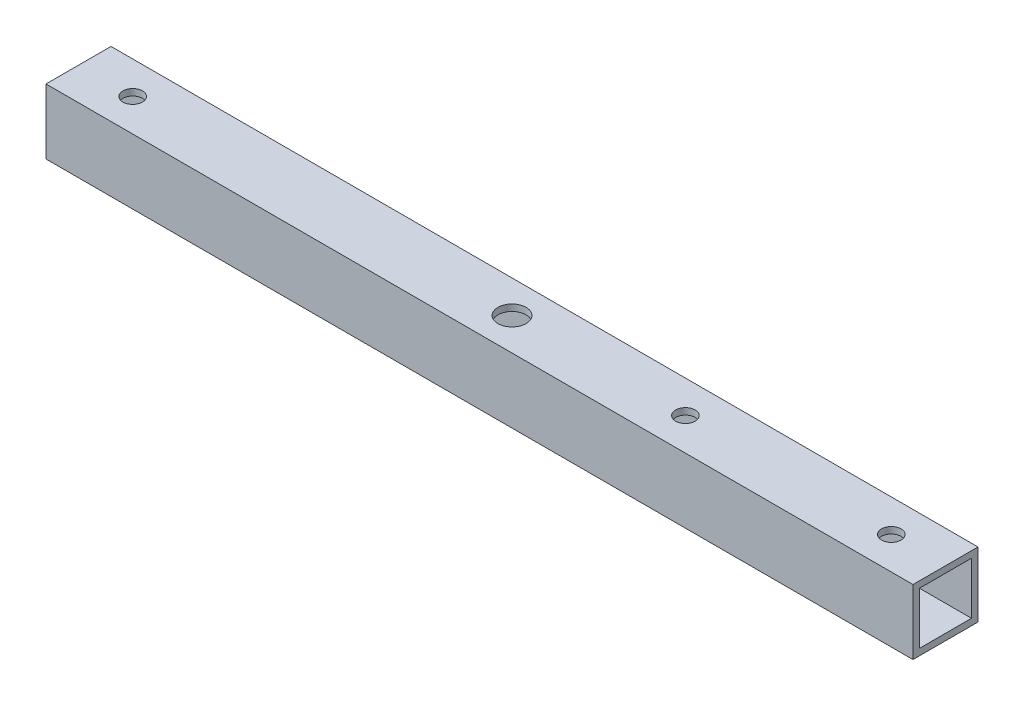
ISO-10303-21;
HEADER;
FILE_DESCRIPTION(('STEP AP214'),'2;1');
FILE_NAME('part.step','',(''),(''),'','','');
FILE_SCHEMA(('AUTOMOTIVE_DESIGN { 1 0 10303 214 1 1 1 1 }'));
ENDSEC;
DATA;
#1=APPLICATION_CONTEXT('core data for automotive mechanical design processes');
#2=APPLICATION_PROTOCOL_DEFINITION('international standard','automotive_design',2000,#1);
#3=PRODUCT_CONTEXT('',#1,'mechanical');
#4=PRODUCT('Part','Part','',(#3));
#5=PRODUCT_RELATED_PRODUCT_CATEGORY('part','',(#4));
#6=PRODUCT_DEFINITION_FORMATION('','',#4);
#7=PRODUCT_DEFINITION_CONTEXT('part definition',#1,'design');
#8=PRODUCT_DEFINITION('design','',#6,#7);
#9=PRODUCT_DEFINITION_SHAPE('','',#8);
#10=(LENGTH_UNIT() NAMED_UNIT(*) SI_UNIT(.MILLI.,.METRE.));
#11=(NAMED_UNIT(*) PLANE_ANGLE_UNIT() SI_UNIT($,.RADIAN.));
#12=(NAMED_UNIT(*) SI_UNIT($,.STERADIAN.) SOLID_ANGLE_UNIT());
#13=UNCERTAINTY_MEASURE_WITH_UNIT(LENGTH_MEASURE(1.E-05),#10,'distance_accuracy_value','');
#14=(GEOMETRIC_REPRESENTATION_CONTEXT(3) GLOBAL_UNCERTAINTY_ASSIGNED_CONTEXT((#13)) GLOBAL_UNIT_ASSIGNED_CONTEXT((#10,
#11,#12)) REPRESENTATION_CONTEXT('',''));
#15=CARTESIAN_POINT('',(0.,0.,0.));
#16=DIRECTION('',(0.,0.,1.));
#17=DIRECTION('',(1.,0.,0.));
#18=AXIS2_PLACEMENT_3D('',#15,#16,#17);
#19=CARTESIAN_POINT('',(200.,0.,0.));
#20=DIRECTION('',(1.,0.,0.));
#21=DIRECTION('',(0.,0.,-1.));
#22=AXIS2_PLACEMENT_3D('',#19,#20,#21);
#23=PLANE('',#22);
#24=DIRECTION('',(0.,1.,0.));
#25=VECTOR('',#24,1.);
#26=CARTESIAN_POINT('',(200.,7.5,-7.5));
#27=LINE('',#26,#25);
#28=CARTESIAN_POINT('',(200.,-7.5,-7.5));
#29=VERTEX_POINT('',#28);
#30=CARTESIAN_POINT('',(200.,7.5,-7.5));
#31=VERTEX_POINT('',#30);
#32=EDGE_CURVE('E138',#29,#31,#27,.T.);
#33=ORIENTED_EDGE('',*,*,#32,.T.);
#34=DIRECTION('',(0.,0.,1.));
#35=VECTOR('',#34,1.);
#36=CARTESIAN_POINT('',(200.,7.5,7.5));
#37=LINE('',#36,#35);
#38=CARTESIAN_POINT('',(200.,7.5,7.5));
#39=VERTEX_POINT('',#38);
#40=EDGE_CURVE('E141',#31,#39,#37,.T.);
#41=ORIENTED_EDGE('',*,*,#40,.T.);
#42=DIRECTION('',(0.,-1.,0.));
#43=VECTOR('',#42,1.);
#44=CARTESIAN_POINT('',(200.,7.5,7.5));
#45=LINE('',#44,#43);
#46=CARTESIAN_POINT('',(200.,-7.5,7.5));
#47=VERTEX_POINT('',#46);
#48=EDGE_CURVE('E144',#39,#47,#45,.T.);
#49=ORIENTED_EDGE('',*,*,#48,.T.);
#50=DIRECTION('',(0.,0.,-1.));
#51=VECTOR('',#50,1.);
#52=CARTESIAN_POINT('',(200.,-7.5,7.5));
#53=LINE('',#52,#51);
#54=EDGE_CURVE('E146',#47,#29,#53,.T.);
#55=ORIENTED_EDGE('',*,*,#54,.T.);
#56=EDGE_LOOP('',(#33,#41,#49,#55));
#57=FACE_BOUND('',#56,.T.);
#58=DIRECTION('',(0.,0.,-1.));
#59=VECTOR('',#58,1.);
#60=CARTESIAN_POINT('',(200.,-6.,6.));
#61=LINE('',#60,#59);
#62=CARTESIAN_POINT('',(200.,-6.,6.));
#63=VERTEX_POINT('',#62);
#64=CARTESIAN_POINT('',(200.,-6.,-6.));
#65=VERTEX_POINT('',#64);
#66=EDGE_CURVE('E108',#63,#65,#61,.T.);
#67=ORIENTED_EDGE('',*,*,#66,.F.);
#68=DIRECTION('',(0.,-1.,0.));
#69=VECTOR('',#68,1.);
#70=CARTESIAN_POINT('',(200.,6.,6.));
#71=LINE('',#70,#69);
#72=CARTESIAN_POINT('',(200.,6.,6.));
#73=VERTEX_POINT('',#72);
#74=EDGE_CURVE('E100',#73,#63,#71,.T.);
#75=ORIENTED_EDGE('',*,*,#74,.F.);
#76=DIRECTION('',(0.,0.,1.));
#77=VECTOR('',#76,1.);
#78=CARTESIAN_POINT('',(200.,6.,6.));
#79=LINE('',#78,#77);
#80=CARTESIAN_POINT('',(200.,6.,-6.));
#81=VERTEX_POINT('',#80);
#82=EDGE_CURVE('E122',#81,#73,#79,.T.);
#83=ORIENTED_EDGE('',*,*,#82,.F.);
#84=DIRECTION('',(0.,1.,0.));
#85=VECTOR('',#84,1.);
#86=CARTESIAN_POINT('',(200.,6.,-6.));
#87=LINE('',#86,#85);
#88=EDGE_CURVE('E120',#65,#81,#87,.T.);
#89=ORIENTED_EDGE('',*,*,#88,.F.);
#90=EDGE_LOOP('',(#67,#75,#83,#89));
#91=FACE_BOUND('',#90,.T.);
#92=ADVANCED_FACE('F33',(#57,#91),#23,.T.);
#93=CARTESIAN_POINT('',(0.,0.,0.));
#94=DIRECTION('',(1.,0.,0.));
#95=DIRECTION('',(0.,0.,-1.));
#96=AXIS2_PLACEMENT_3D('',#93,#94,#95);
#97=PLANE('',#96);
#98=DIRECTION('',(0.,1.,0.));
#99=VECTOR('',#98,1.);
#100=CARTESIAN_POINT('',(0.,7.5,-7.5));
#101=LINE('',#100,#99);
#102=CARTESIAN_POINT('',(0.,-7.5,-7.5));
#103=VERTEX_POINT('',#102);
#104=CARTESIAN_POINT('',(0.,7.5,-7.5));
#105=VERTEX_POINT('',#104);
#106=EDGE_CURVE('E116',#103,#105,#101,.T.);
#107=ORIENTED_EDGE('',*,*,#106,.F.);
#108=DIRECTION('',(0.,0.,-1.));
#109=VECTOR('',#108,1.);
#110=CARTESIAN_POINT('',(0.,-7.5,7.5));
#111=LINE('',#110,#109);
#112=CARTESIAN_POINT('',(0.,-7.5,7.5));
#113=VERTEX_POINT('',#112);
#114=EDGE_CURVE('E142',#113,#103,#111,.T.);
#115=ORIENTED_EDGE('',*,*,#114,.F.);
#116=DIRECTION('',(0.,-1.,0.));
#117=VECTOR('',#116,1.);
#118=CARTESIAN_POINT('',(0.,7.5,7.5));
#119=LINE('',#118,#117);
#120=CARTESIAN_POINT('',(0.,7.5,7.5));
#121=VERTEX_POINT('',#120);
#122=EDGE_CURVE('E153',#121,#113,#119,.T.);
#123=ORIENTED_EDGE('',*,*,#122,.F.);
#124=DIRECTION('',(0.,0.,1.));
#125=VECTOR('',#124,1.);
#126=CARTESIAN_POINT('',(0.,7.5,7.5));
#127=LINE('',#126,#125);
#128=EDGE_CURVE('E151',#105,#121,#127,.T.);
#129=ORIENTED_EDGE('',*,*,#128,.F.);
#130=EDGE_LOOP('',(#107,#115,#123,#129));
#131=FACE_BOUND('',#130,.T.);
#132=DIRECTION('',(0.,-1.,0.));
#133=VECTOR('',#132,1.);
#134=CARTESIAN_POINT('',(0.,6.,6.));
#135=LINE('',#134,#133);
#136=CARTESIAN_POINT('',(0.,6.,6.));
#137=VERTEX_POINT('',#136);
#138=CARTESIAN_POINT('',(0.,-6.,6.));
#139=VERTEX_POINT('',#138);
#140=EDGE_CURVE('E58',#137,#139,#135,.T.);
#141=ORIENTED_EDGE('',*,*,#140,.T.);
#142=DIRECTION('',(0.,0.,-1.));
#143=VECTOR('',#142,1.);
#144=CARTESIAN_POINT('',(0.,-6.,6.));
#145=LINE('',#144,#143);
#146=CARTESIAN_POINT('',(0.,-6.,-6.));
#147=VERTEX_POINT('',#146);
#148=EDGE_CURVE('E115',#139,#147,#145,.T.);
#149=ORIENTED_EDGE('',*,*,#148,.T.);
#150=DIRECTION('',(0.,1.,0.));
#151=VECTOR('',#150,1.);
#152=CARTESIAN_POINT('',(0.,6.,-6.));
#153=LINE('',#152,#151);
#154=CARTESIAN_POINT('',(0.,6.,-6.));
#155=VERTEX_POINT('',#154);
#156=EDGE_CURVE('E130',#147,#155,#153,.T.);
#157=ORIENTED_EDGE('',*,*,#156,.T.);
#158=DIRECTION('',(0.,0.,1.));
#159=VECTOR('',#158,1.);
#160=CARTESIAN_POINT('',(0.,6.,6.));
#161=LINE('',#160,#159);
#162=EDGE_CURVE('E109',#155,#137,#161,.T.);
#163=ORIENTED_EDGE('',*,*,#162,.T.);
#164=EDGE_LOOP('',(#141,#149,#157,#163));
#165=FACE_BOUND('',#164,.T.);
#166=ADVANCED_FACE('F223',(#131,#165),#97,.F.);
#167=CARTESIAN_POINT('',(200.,7.5,-7.5));
#168=DIRECTION('',(0.,0.,1.));
#169=DIRECTION('',(0.,-1.,0.));
#170=AXIS2_PLACEMENT_3D('',#167,#168,#169);
#171=PLANE('',#170);
#172=ORIENTED_EDGE('',*,*,#106,.T.);
#173=DIRECTION('',(-1.,0.,0.));
#174=VECTOR('',#173,1.);
#175=CARTESIAN_POINT('',(200.,7.5,-7.5));
#176=LINE('',#175,#174);
#177=EDGE_CURVE('E11',#31,#105,#176,.T.);
#178=ORIENTED_EDGE('',*,*,#177,.F.);
#179=ORIENTED_EDGE('',*,*,#32,.F.);
#180=DIRECTION('',(-1.,0.,0.));
#181=VECTOR('',#180,1.);
#182=CARTESIAN_POINT('',(200.,-7.5,-7.5));
#183=LINE('',#182,#181);
#184=EDGE_CURVE('E148',#29,#103,#183,.T.);
#185=ORIENTED_EDGE('',*,*,#184,.T.);
#186=EDGE_LOOP('',(#172,#178,#179,#185));
#187=FACE_BOUND('',#186,.T.);
#188=ADVANCED_FACE('F35',(#187),#171,.F.);
#189=CARTESIAN_POINT('',(200.,7.5,7.5));
#190=DIRECTION('',(0.,-1.,0.));
#191=DIRECTION('',(0.,0.,-1.));
#192=AXIS2_PLACEMENT_3D('',#189,#190,#191);
#193=PLANE('',#192);
#194=CARTESIAN_POINT('',(187.5,7.5,0.));
#195=DIRECTION('',(0.,1.,0.));
#196=DIRECTION('',(0.,0.,-1.));
#197=AXIS2_PLACEMENT_3D('',#194,#195,#196);
#198=CIRCLE('',#197,2.24999999999998);
#199=CARTESIAN_POINT('',(187.5,7.5,-2.25));
#200=VERTEX_POINT('',#199);
#201=EDGE_CURVE('E248',#200,#200,#198,.T.);
#202=ORIENTED_EDGE('',*,*,#201,.F.);
#203=EDGE_LOOP('',(#202));
#204=FACE_BOUND('',#203,.T.);
#205=CARTESIAN_POINT('',(12.5,7.5,0.));
#206=DIRECTION('',(0.,1.,0.));
#207=DIRECTION('',(0.,0.,1.));
#208=AXIS2_PLACEMENT_3D('',#205,#206,#207);
#209=CIRCLE('',#208,2.25);
#210=CARTESIAN_POINT('',(12.5,7.5,2.25));
#211=VERTEX_POINT('',#210);
#212=EDGE_CURVE('E181',#211,#211,#209,.T.);
#213=ORIENTED_EDGE('',*,*,#212,.F.);
#214=EDGE_LOOP('',(#213));
#215=FACE_BOUND('',#214,.T.);
#216=CARTESIAN_POINT('',(140.,7.5,0.));
#217=DIRECTION('',(0.,1.,0.));
#218=DIRECTION('',(0.,0.,1.));
#219=AXIS2_PLACEMENT_3D('',#216,#217,#218);
#220=CIRCLE('',#219,2.25000000000001);
#221=CARTESIAN_POINT('',(140.,7.5,2.25000000000001));
#222=VERTEX_POINT('',#221);
#223=EDGE_CURVE('E178',#222,#222,#220,.T.);
#224=ORIENTED_EDGE('',*,*,#223,.F.);
#225=EDGE_LOOP('',(#224));
#226=FACE_BOUND('',#225,.T.);
#227=CARTESIAN_POINT('',(100.,7.5,0.));
#228=DIRECTION('',(0.,1.,0.));
#229=DIRECTION('',(0.,0.,1.));
#230=AXIS2_PLACEMENT_3D('',#227,#228,#229);
#231=CIRCLE('',#230,3.25000000000001);
#232=CARTESIAN_POINT('',(100.,7.5,3.25000000000001));
#233=VERTEX_POINT('',#232);
#234=EDGE_CURVE('E197',#233,#233,#231,.T.);
#235=ORIENTED_EDGE('',*,*,#234,.F.);
#236=EDGE_LOOP('',(#235));
#237=FACE_BOUND('',#236,.T.);
#238=ORIENTED_EDGE('',*,*,#128,.T.);
#239=DIRECTION('',(-1.,0.,0.));
#240=VECTOR('',#239,1.);
#241=CARTESIAN_POINT('',(200.,7.5,7.5));
#242=LINE('',#241,#240);
#243=EDGE_CURVE('E42',#39,#121,#242,.T.);
#244=ORIENTED_EDGE('',*,*,#243,.F.);
#245=ORIENTED_EDGE('',*,*,#40,.F.);
#246=ORIENTED_EDGE('',*,*,#177,.T.);
#247=EDGE_LOOP('',(#238,#244,#245,#246));
#248=FACE_BOUND('',#247,.T.);
#249=ADVANCED_FACE('F237',(#204,#215,#226,#237,#248),#193,.F.);
#250=CARTESIAN_POINT('',(200.,7.5,7.5));
#251=DIRECTION('',(0.,0.,-1.));
#252=DIRECTION('',(0.,1.,0.));
#253=AXIS2_PLACEMENT_3D('',#250,#251,#252);
#254=PLANE('',#253);
#255=ORIENTED_EDGE('',*,*,#122,.T.);
#256=DIRECTION('',(-1.,0.,0.));
#257=VECTOR('',#256,1.);
#258=CARTESIAN_POINT('',(200.,-7.5,7.5));
#259=LINE('',#258,#257);
#260=EDGE_CURVE('E158',#47,#113,#259,.T.);
#261=ORIENTED_EDGE('',*,*,#260,.F.);
#262=ORIENTED_EDGE('',*,*,#48,.F.);
#263=ORIENTED_EDGE('',*,*,#243,.T.);
#264=EDGE_LOOP('',(#255,#261,#262,#263));
#265=FACE_BOUND('',#264,.T.);
#266=ADVANCED_FACE('F234',(#265),#254,.F.);
#267=CARTESIAN_POINT('',(200.,-7.5,7.5));
#268=DIRECTION('',(0.,1.,0.));
#269=DIRECTION('',(0.,0.,1.));
#270=AXIS2_PLACEMENT_3D('',#267,#268,#269);
#271=PLANE('',#270);
#272=CARTESIAN_POINT('',(187.5,-7.5,0.));
#273=DIRECTION('',(0.,1.,0.));
#274=DIRECTION('',(0.,0.,-1.));
#275=AXIS2_PLACEMENT_3D('',#272,#273,#274);
#276=CIRCLE('',#275,2.24999999999998);
#277=CARTESIAN_POINT('',(187.5,-7.5,-2.25));
#278=VERTEX_POINT('',#277);
#279=EDGE_CURVE('E301',#278,#278,#276,.T.);
#280=ORIENTED_EDGE('',*,*,#279,.T.);
#281=EDGE_LOOP('',(#280));
#282=FACE_BOUND('',#281,.T.);
#283=CARTESIAN_POINT('',(12.5,-7.5,0.));
#284=DIRECTION('',(0.,1.,0.));
#285=DIRECTION('',(0.,0.,1.));
#286=AXIS2_PLACEMENT_3D('',#283,#284,#285);
#287=CIRCLE('',#286,2.25);
#288=CARTESIAN_POINT('',(12.5,-7.5,2.25));
#289=VERTEX_POINT('',#288);
#290=EDGE_CURVE('E174',#289,#289,#287,.T.);
#291=ORIENTED_EDGE('',*,*,#290,.T.);
#292=EDGE_LOOP('',(#291));
#293=FACE_BOUND('',#292,.T.);
#294=CARTESIAN_POINT('',(140.,-7.5,0.));
#295=DIRECTION('',(0.,1.,0.));
#296=DIRECTION('',(0.,0.,1.));
#297=AXIS2_PLACEMENT_3D('',#294,#295,#296);
#298=CIRCLE('',#297,2.25000000000001);
#299=CARTESIAN_POINT('',(140.,-7.5,2.25000000000001));
#300=VERTEX_POINT('',#299);
#301=EDGE_CURVE('E170',#300,#300,#298,.T.);
#302=ORIENTED_EDGE('',*,*,#301,.T.);
#303=EDGE_LOOP('',(#302));
#304=FACE_BOUND('',#303,.T.);
#305=CARTESIAN_POINT('',(100.,-7.5,0.));
#306=DIRECTION('',(0.,1.,0.));
#307=DIRECTION('',(0.,0.,1.));
#308=AXIS2_PLACEMENT_3D('',#305,#306,#307);
#309=CIRCLE('',#308,3.25000000000001);
#310=CARTESIAN_POINT('',(100.,-7.5,3.25000000000001));
#311=VERTEX_POINT('',#310);
#312=EDGE_CURVE('E166',#311,#311,#309,.T.);
#313=ORIENTED_EDGE('',*,*,#312,.T.);
#314=EDGE_LOOP('',(#313));
#315=FACE_BOUND('',#314,.T.);
#316=ORIENTED_EDGE('',*,*,#114,.T.);
#317=ORIENTED_EDGE('',*,*,#184,.F.);
#318=ORIENTED_EDGE('',*,*,#54,.F.);
#319=ORIENTED_EDGE('',*,*,#260,.T.);
#320=EDGE_LOOP('',(#316,#317,#318,#319));
#321=FACE_BOUND('',#320,.T.);
#322=ADVANCED_FACE('F218',(#282,#293,#304,#315,#321),#271,.F.);
#323=CARTESIAN_POINT('',(200.,6.,6.));
#324=DIRECTION('',(0.,0.,-1.));
#325=DIRECTION('',(0.,1.,0.));
#326=AXIS2_PLACEMENT_3D('',#323,#324,#325);
#327=PLANE('',#326);
#328=ORIENTED_EDGE('',*,*,#140,.F.);
#329=DIRECTION('',(-1.,0.,0.));
#330=VECTOR('',#329,1.);
#331=CARTESIAN_POINT('',(200.,6.,6.));
#332=LINE('',#331,#330);
#333=EDGE_CURVE('E104',#73,#137,#332,.T.);
#334=ORIENTED_EDGE('',*,*,#333,.F.);
#335=ORIENTED_EDGE('',*,*,#74,.T.);
#336=DIRECTION('',(-1.,0.,0.));
#337=VECTOR('',#336,1.);
#338=CARTESIAN_POINT('',(200.,-6.,6.));
#339=LINE('',#338,#337);
#340=EDGE_CURVE('E103',#63,#139,#339,.T.);
#341=ORIENTED_EDGE('',*,*,#340,.T.);
#342=EDGE_LOOP('',(#328,#334,#335,#341));
#343=FACE_BOUND('',#342,.T.);
#344=ADVANCED_FACE('F102',(#343),#327,.T.);
#345=CARTESIAN_POINT('',(200.,-6.,6.));
#346=DIRECTION('',(0.,1.,0.));
#347=DIRECTION('',(0.,0.,1.));
#348=AXIS2_PLACEMENT_3D('',#345,#346,#347);
#349=PLANE('',#348);
#350=CARTESIAN_POINT('',(187.5,-6.,0.));
#351=DIRECTION('',(0.,1.,0.));
#352=DIRECTION('',(0.,0.,1.));
#353=AXIS2_PLACEMENT_3D('',#350,#351,#352);
#354=CIRCLE('',#353,2.24999999999998);
#355=CARTESIAN_POINT('',(187.5,-6.,2.24999999999996));
#356=VERTEX_POINT('',#355);
#357=EDGE_CURVE('E186',#356,#356,#354,.T.);
#358=ORIENTED_EDGE('',*,*,#357,.F.);
#359=EDGE_LOOP('',(#358));
#360=FACE_BOUND('',#359,.T.);
#361=CARTESIAN_POINT('',(12.5,-6.,0.));
#362=DIRECTION('',(0.,1.,0.));
#363=DIRECTION('',(0.,0.,1.));
#364=AXIS2_PLACEMENT_3D('',#361,#362,#363);
#365=CIRCLE('',#364,2.25);
#366=CARTESIAN_POINT('',(12.5,-6.,2.25));
#367=VERTEX_POINT('',#366);
#368=EDGE_CURVE('E173',#367,#367,#365,.T.);
#369=ORIENTED_EDGE('',*,*,#368,.F.);
#370=EDGE_LOOP('',(#369));
#371=FACE_BOUND('',#370,.T.);
#372=CARTESIAN_POINT('',(140.,-6.,0.));
#373=DIRECTION('',(0.,1.,0.));
#374=DIRECTION('',(0.,0.,1.));
#375=AXIS2_PLACEMENT_3D('',#372,#373,#374);
#376=CIRCLE('',#375,2.25000000000001);
#377=CARTESIAN_POINT('',(140.,-6.,2.25000000000001));
#378=VERTEX_POINT('',#377);
#379=EDGE_CURVE('E169',#378,#378,#376,.T.);
#380=ORIENTED_EDGE('',*,*,#379,.F.);
#381=EDGE_LOOP('',(#380));
#382=FACE_BOUND('',#381,.T.);
#383=CARTESIAN_POINT('',(100.,-6.,0.));
#384=DIRECTION('',(0.,1.,0.));
#385=DIRECTION('',(0.,0.,1.));
#386=AXIS2_PLACEMENT_3D('',#383,#384,#385);
#387=CIRCLE('',#386,3.25000000000001);
#388=CARTESIAN_POINT('',(100.,-6.,3.25000000000001));
#389=VERTEX_POINT('',#388);
#390=EDGE_CURVE('E128',#389,#389,#387,.T.);
#391=ORIENTED_EDGE('',*,*,#390,.F.);
#392=EDGE_LOOP('',(#391));
#393=FACE_BOUND('',#392,.T.);
#394=ORIENTED_EDGE('',*,*,#148,.F.);
#395=ORIENTED_EDGE('',*,*,#340,.F.);
#396=ORIENTED_EDGE('',*,*,#66,.T.);
#397=DIRECTION('',(-1.,0.,0.));
#398=VECTOR('',#397,1.);
#399=CARTESIAN_POINT('',(200.,-6.,-6.));
#400=LINE('',#399,#398);
#401=EDGE_CURVE('E117',#65,#147,#400,.T.);
#402=ORIENTED_EDGE('',*,*,#401,.T.);
#403=EDGE_LOOP('',(#394,#395,#396,#402));
#404=FACE_BOUND('',#403,.T.);
#405=ADVANCED_FACE('F112',(#360,#371,#382,#393,#404),#349,.T.);
#406=CARTESIAN_POINT('',(200.,6.,-6.));
#407=DIRECTION('',(0.,0.,1.));
#408=DIRECTION('',(0.,-1.,0.));
#409=AXIS2_PLACEMENT_3D('',#406,#407,#408);
#410=PLANE('',#409);
#411=ORIENTED_EDGE('',*,*,#156,.F.);
#412=ORIENTED_EDGE('',*,*,#401,.F.);
#413=ORIENTED_EDGE('',*,*,#88,.T.);
#414=DIRECTION('',(-1.,0.,0.));
#415=VECTOR('',#414,1.);
#416=CARTESIAN_POINT('',(200.,6.,-6.));
#417=LINE('',#416,#415);
#418=EDGE_CURVE('E50',#81,#155,#417,.T.);
#419=ORIENTED_EDGE('',*,*,#418,.T.);
#420=EDGE_LOOP('',(#411,#412,#413,#419));
#421=FACE_BOUND('',#420,.T.);
#422=ADVANCED_FACE('F208',(#421),#410,.T.);
#423=CARTESIAN_POINT('',(200.,6.,6.));
#424=DIRECTION('',(0.,-1.,0.));
#425=DIRECTION('',(0.,0.,-1.));
#426=AXIS2_PLACEMENT_3D('',#423,#424,#425);
#427=PLANE('',#426);
#428=CARTESIAN_POINT('',(187.5,6.,0.));
#429=DIRECTION('',(0.,-1.,0.));
#430=DIRECTION('',(0.,0.,-1.));
#431=AXIS2_PLACEMENT_3D('',#428,#429,#430);
#432=CIRCLE('',#431,2.24999999999998);
#433=CARTESIAN_POINT('',(187.5,6.,-2.25));
#434=VERTEX_POINT('',#433);
#435=EDGE_CURVE('E37',#434,#434,#432,.T.);
#436=ORIENTED_EDGE('',*,*,#435,.F.);
#437=EDGE_LOOP('',(#436));
#438=FACE_BOUND('',#437,.T.);
#439=CARTESIAN_POINT('',(12.5,6.,0.));
#440=DIRECTION('',(0.,-1.,0.));
#441=DIRECTION('',(0.,0.,-1.));
#442=AXIS2_PLACEMENT_3D('',#439,#440,#441);
#443=CIRCLE('',#442,2.25);
#444=CARTESIAN_POINT('',(12.5,6.,-2.25));
#445=VERTEX_POINT('',#444);
#446=EDGE_CURVE('E171',#445,#445,#443,.T.);
#447=ORIENTED_EDGE('',*,*,#446,.F.);
#448=EDGE_LOOP('',(#447));
#449=FACE_BOUND('',#448,.T.);
#450=CARTESIAN_POINT('',(140.,6.,0.));
#451=DIRECTION('',(0.,-1.,0.));
#452=DIRECTION('',(0.,0.,-1.));
#453=AXIS2_PLACEMENT_3D('',#450,#451,#452);
#454=CIRCLE('',#453,2.25000000000001);
#455=CARTESIAN_POINT('',(140.,6.,-2.25000000000001));
#456=VERTEX_POINT('',#455);
#457=EDGE_CURVE('E167',#456,#456,#454,.T.);
#458=ORIENTED_EDGE('',*,*,#457,.F.);
#459=EDGE_LOOP('',(#458));
#460=FACE_BOUND('',#459,.T.);
#461=CARTESIAN_POINT('',(100.,6.,0.));
#462=DIRECTION('',(0.,-1.,0.));
#463=DIRECTION('',(0.,0.,-1.));
#464=AXIS2_PLACEMENT_3D('',#461,#462,#463);
#465=CIRCLE('',#464,3.25000000000001);
#466=CARTESIAN_POINT('',(100.,6.,-3.25000000000001));
#467=VERTEX_POINT('',#466);
#468=EDGE_CURVE('E163',#467,#467,#465,.T.);
#469=ORIENTED_EDGE('',*,*,#468,.F.);
#470=EDGE_LOOP('',(#469));
#471=FACE_BOUND('',#470,.T.);
#472=ORIENTED_EDGE('',*,*,#162,.F.);
#473=ORIENTED_EDGE('',*,*,#418,.F.);
#474=ORIENTED_EDGE('',*,*,#82,.T.);
#475=ORIENTED_EDGE('',*,*,#333,.T.);
#476=EDGE_LOOP('',(#472,#473,#474,#475));
#477=FACE_BOUND('',#476,.T.);
#478=ADVANCED_FACE('F215',(#438,#449,#460,#471,#477),#427,.T.);
#479=CARTESIAN_POINT('',(100.,-7.5,0.));
#480=DIRECTION('',(0.,1.,0.));
#481=DIRECTION('',(0.,0.,1.));
#482=AXIS2_PLACEMENT_3D('',#479,#480,#481);
#483=CYLINDRICAL_SURFACE('',#482,3.25000000000001);
#484=ORIENTED_EDGE('',*,*,#468,.T.);
#485=EDGE_LOOP('',(#484));
#486=FACE_BOUND('',#485,.T.);
#487=ORIENTED_EDGE('',*,*,#234,.T.);
#488=EDGE_LOOP('',(#487));
#489=FACE_BOUND('',#488,.T.);
#490=ADVANCED_FACE('F269',(#486,#489),#483,.F.);
#491=ORIENTED_EDGE('',*,*,#390,.T.);
#492=EDGE_LOOP('',(#491));
#493=FACE_BOUND('',#492,.T.);
#494=ORIENTED_EDGE('',*,*,#312,.F.);
#495=EDGE_LOOP('',(#494));
#496=FACE_BOUND('',#495,.T.);
#497=ADVANCED_FACE('F204',(#493,#496),#483,.F.);
#498=CARTESIAN_POINT('',(140.,-7.5,0.));
#499=DIRECTION('',(0.,1.,0.));
#500=DIRECTION('',(0.,0.,1.));
#501=AXIS2_PLACEMENT_3D('',#498,#499,#500);
#502=CYLINDRICAL_SURFACE('',#501,2.25000000000001);
#503=ORIENTED_EDGE('',*,*,#457,.T.);
#504=EDGE_LOOP('',(#503));
#505=FACE_BOUND('',#504,.T.);
#506=ORIENTED_EDGE('',*,*,#223,.T.);
#507=EDGE_LOOP('',(#506));
#508=FACE_BOUND('',#507,.T.);
#509=ADVANCED_FACE('F280',(#505,#508),#502,.F.);
#510=ORIENTED_EDGE('',*,*,#379,.T.);
#511=EDGE_LOOP('',(#510));
#512=FACE_BOUND('',#511,.T.);
#513=ORIENTED_EDGE('',*,*,#301,.F.);
#514=EDGE_LOOP('',(#513));
#515=FACE_BOUND('',#514,.T.);
#516=ADVANCED_FACE('F283',(#512,#515),#502,.F.);
#517=CARTESIAN_POINT('',(12.5,-7.5,0.));
#518=DIRECTION('',(0.,1.,0.));
#519=DIRECTION('',(0.,0.,1.));
#520=AXIS2_PLACEMENT_3D('',#517,#518,#519);
#521=CYLINDRICAL_SURFACE('',#520,2.25);
#522=ORIENTED_EDGE('',*,*,#446,.T.);
#523=EDGE_LOOP('',(#522));
#524=FACE_BOUND('',#523,.T.);
#525=ORIENTED_EDGE('',*,*,#212,.T.);
#526=EDGE_LOOP('',(#525));
#527=FACE_BOUND('',#526,.T.);
#528=ADVANCED_FACE('F285',(#524,#527),#521,.F.);
#529=ORIENTED_EDGE('',*,*,#368,.T.);
#530=EDGE_LOOP('',(#529));
#531=FACE_BOUND('',#530,.T.);
#532=ORIENTED_EDGE('',*,*,#290,.F.);
#533=EDGE_LOOP('',(#532));
#534=FACE_BOUND('',#533,.T.);
#535=ADVANCED_FACE('F288',(#531,#534),#521,.F.);
#536=CARTESIAN_POINT('',(187.5,-7.5,0.));
#537=DIRECTION('',(0.,1.,0.));
#538=DIRECTION('',(0.,0.,1.));
#539=AXIS2_PLACEMENT_3D('',#536,#537,#538);
#540=CYLINDRICAL_SURFACE('',#539,2.24999999999998);
#541=ORIENTED_EDGE('',*,*,#435,.T.);
#542=EDGE_LOOP('',(#541));
#543=FACE_BOUND('',#542,.T.);
#544=ORIENTED_EDGE('',*,*,#201,.T.);
#545=EDGE_LOOP('',(#544));
#546=FACE_BOUND('',#545,.T.);
#547=ADVANCED_FACE('F289',(#543,#546),#540,.F.);
#548=ORIENTED_EDGE('',*,*,#357,.T.);
#549=EDGE_LOOP('',(#548));
#550=FACE_BOUND('',#549,.T.);
#551=ORIENTED_EDGE('',*,*,#279,.F.);
#552=EDGE_LOOP('',(#551));
#553=FACE_BOUND('',#552,.T.);
#554=ADVANCED_FACE('F291',(#550,#553),#540,.F.);
#555=CLOSED_SHELL('',(#92,#166,#188,#249,#266,#322,#344,#405,#422,#478,#490,#497,#509,#516,#528,
#535,#547,#554));
#556=MANIFOLD_SOLID_BREP('B2',#555);
#557=ADVANCED_BREP_SHAPE_REPRESENTATION('',(#18,#556),#14);
#558=SHAPE_DEFINITION_REPRESENTATION(#9,#557);
ENDSEC;
END-ISO-10303-21;
